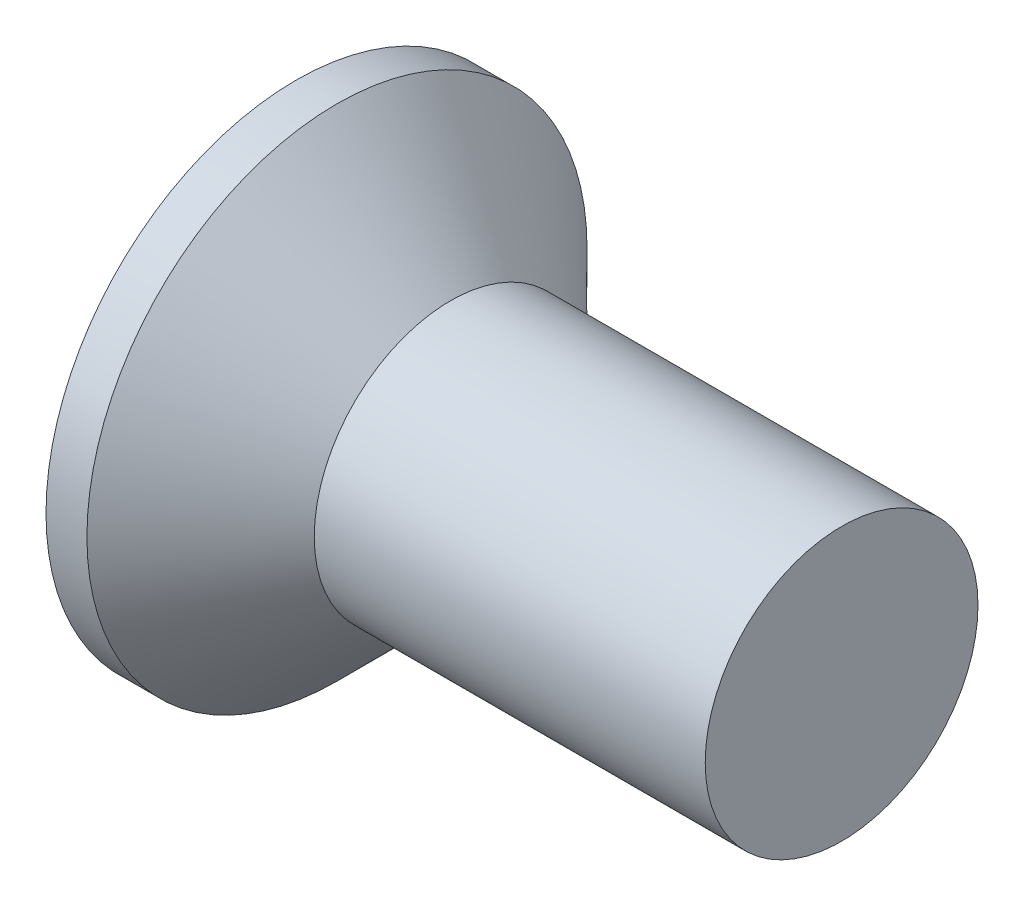
ISO-10303-21;
HEADER;
FILE_DESCRIPTION(('STEP AP214'),'2;1');
FILE_NAME('part.step','',(''),(''),'','','');
FILE_SCHEMA(('AUTOMOTIVE_DESIGN { 1 0 10303 214 1 1 1 1 }'));
ENDSEC;
DATA;
#1=APPLICATION_CONTEXT('core data for automotive mechanical design processes');
#2=APPLICATION_PROTOCOL_DEFINITION('international standard','automotive_design',2000,#1);
#3=PRODUCT_CONTEXT('',#1,'mechanical');
#4=PRODUCT('Part','Part','',(#3));
#5=PRODUCT_RELATED_PRODUCT_CATEGORY('part','',(#4));
#6=PRODUCT_DEFINITION_FORMATION('','',#4);
#7=PRODUCT_DEFINITION_CONTEXT('part definition',#1,'design');
#8=PRODUCT_DEFINITION('design','',#6,#7);
#9=PRODUCT_DEFINITION_SHAPE('','',#8);
#10=(LENGTH_UNIT() NAMED_UNIT(*) SI_UNIT(.MILLI.,.METRE.));
#11=(NAMED_UNIT(*) PLANE_ANGLE_UNIT() SI_UNIT($,.RADIAN.));
#12=(NAMED_UNIT(*) SI_UNIT($,.STERADIAN.) SOLID_ANGLE_UNIT());
#13=UNCERTAINTY_MEASURE_WITH_UNIT(LENGTH_MEASURE(1.E-05),#10,'distance_accuracy_value','');
#14=(GEOMETRIC_REPRESENTATION_CONTEXT(3) GLOBAL_UNCERTAINTY_ASSIGNED_CONTEXT((#13)) GLOBAL_UNIT_ASSIGNED_CONTEXT((#10,
#11,#12)) REPRESENTATION_CONTEXT('',''));
#15=CARTESIAN_POINT('',(0.,0.,0.));
#16=DIRECTION('',(0.,0.,1.));
#17=DIRECTION('',(1.,0.,0.));
#18=AXIS2_PLACEMENT_3D('',#15,#16,#17);
#19=CARTESIAN_POINT('',(0.,0.,0.));
#20=DIRECTION('',(-1.,0.,0.));
#21=DIRECTION('',(0.,0.,1.));
#22=AXIS2_PLACEMENT_3D('',#19,#20,#21);
#23=PLANE('',#22);
#24=CARTESIAN_POINT('',(0.,0.,0.));
#25=DIRECTION('',(-1.,0.,0.));
#26=DIRECTION('',(0.,0.,1.));
#27=AXIS2_PLACEMENT_3D('',#24,#25,#26);
#28=CIRCLE('',#27,2.75);
#29=CARTESIAN_POINT('',(0.,0.,2.75));
#30=VERTEX_POINT('',#29);
#31=EDGE_CURVE('E41',#30,#30,#28,.T.);
#32=ORIENTED_EDGE('',*,*,#31,.T.);
#33=EDGE_LOOP('',(#32));
#34=FACE_BOUND('',#33,.T.);
#35=DIRECTION('',(0.,1.,0.));
#36=VECTOR('',#35,1.);
#37=CARTESIAN_POINT('',(0.,-1.55,-0.395));
#38=LINE('',#37,#36);
#39=CARTESIAN_POINT('',(0.,-1.55,-0.395));
#40=VERTEX_POINT('',#39);
#41=CARTESIAN_POINT('',(0.,-0.394999999999999,-0.395));
#42=VERTEX_POINT('',#41);
#43=EDGE_CURVE('E102',#40,#42,#38,.T.);
#44=ORIENTED_EDGE('',*,*,#43,.T.);
#45=DIRECTION('',(0.,0.,-1.));
#46=VECTOR('',#45,1.);
#47=CARTESIAN_POINT('',(0.,-0.395000000000005,1.55));
#48=LINE('',#47,#46);
#49=CARTESIAN_POINT('',(0.,-0.394999999999995,-1.55));
#50=VERTEX_POINT('',#49);
#51=EDGE_CURVE('E82',#42,#50,#48,.T.);
#52=ORIENTED_EDGE('',*,*,#51,.T.);
#53=DIRECTION('',(0.,1.,0.));
#54=VECTOR('',#53,1.);
#55=CARTESIAN_POINT('',(0.,-0.394999999999995,-1.55));
#56=LINE('',#55,#54);
#57=CARTESIAN_POINT('',(0.,0.395000000000005,-1.55));
#58=VERTEX_POINT('',#57);
#59=EDGE_CURVE('E339',#50,#58,#56,.T.);
#60=ORIENTED_EDGE('',*,*,#59,.T.);
#61=DIRECTION('',(0.,0.,1.));
#62=VECTOR('',#61,1.);
#63=CARTESIAN_POINT('',(0.,0.395000000000005,-1.55));
#64=LINE('',#63,#62);
#65=CARTESIAN_POINT('',(0.,0.395000000000001,-0.395));
#66=VERTEX_POINT('',#65);
#67=EDGE_CURVE('E98',#58,#66,#64,.T.);
#68=ORIENTED_EDGE('',*,*,#67,.T.);
#69=CARTESIAN_POINT('',(0.,1.55,-0.395));
#70=VERTEX_POINT('',#69);
#71=EDGE_CURVE('E92',#66,#70,#38,.T.);
#72=ORIENTED_EDGE('',*,*,#71,.T.);
#73=DIRECTION('',(0.,0.,1.));
#74=VECTOR('',#73,1.);
#75=CARTESIAN_POINT('',(0.,1.55,-0.395));
#76=LINE('',#75,#74);
#77=CARTESIAN_POINT('',(0.,1.55,0.395));
#78=VERTEX_POINT('',#77);
#79=EDGE_CURVE('E95',#70,#78,#76,.T.);
#80=ORIENTED_EDGE('',*,*,#79,.T.);
#81=DIRECTION('',(0.,-1.,0.));
#82=VECTOR('',#81,1.);
#83=CARTESIAN_POINT('',(0.,1.55,0.395));
#84=LINE('',#83,#82);
#85=CARTESIAN_POINT('',(0.,0.394999999999998,0.395));
#86=VERTEX_POINT('',#85);
#87=EDGE_CURVE('E351',#78,#86,#84,.T.);
#88=ORIENTED_EDGE('',*,*,#87,.T.);
#89=CARTESIAN_POINT('',(0.,0.394999999999994,1.55));
#90=VERTEX_POINT('',#89);
#91=EDGE_CURVE('E334',#86,#90,#64,.T.);
#92=ORIENTED_EDGE('',*,*,#91,.T.);
#93=DIRECTION('',(0.,-1.,0.));
#94=VECTOR('',#93,1.);
#95=CARTESIAN_POINT('',(0.,0.394999999999994,1.55));
#96=LINE('',#95,#94);
#97=CARTESIAN_POINT('',(0.,-0.395000000000005,1.55));
#98=VERTEX_POINT('',#97);
#99=EDGE_CURVE('E320',#90,#98,#96,.T.);
#100=ORIENTED_EDGE('',*,*,#99,.T.);
#101=CARTESIAN_POINT('',(0.,-0.395000000000001,0.395));
#102=VERTEX_POINT('',#101);
#103=EDGE_CURVE('E332',#98,#102,#48,.T.);
#104=ORIENTED_EDGE('',*,*,#103,.T.);
#105=CARTESIAN_POINT('',(0.,-1.55,0.395));
#106=VERTEX_POINT('',#105);
#107=EDGE_CURVE('E108',#102,#106,#84,.T.);
#108=ORIENTED_EDGE('',*,*,#107,.T.);
#109=DIRECTION('',(0.,0.,-1.));
#110=VECTOR('',#109,1.);
#111=CARTESIAN_POINT('',(0.,-1.55,0.395));
#112=LINE('',#111,#110);
#113=EDGE_CURVE('E131',#106,#40,#112,.T.);
#114=ORIENTED_EDGE('',*,*,#113,.T.);
#115=EDGE_LOOP('',(#44,#52,#60,#68,#72,#80,#88,#92,#100,#104,#108,#114));
#116=FACE_BOUND('',#115,.T.);
#117=ADVANCED_FACE('F34',(#34,#116),#23,.T.);
#118=CARTESIAN_POINT('',(2.38373382624769,0.,0.16865988909427));
#119=DIRECTION('',(-0.0945267588569115,0.,-0.995522321125954));
#120=DIRECTION('',(-0.995522321125954,0.,0.0945267588569115));
#121=AXIS2_PLACEMENT_3D('',#118,#119,#120);
#122=PLANE('',#121);
#123=ORIENTED_EDGE('',*,*,#107,.F.);
#124=DIRECTION('',(0.991104257398676,0.0941072552097304,-0.0941072552097301));
#125=VECTOR('',#124,1.);
#126=CARTESIAN_POINT('',(2.39946475118715,-0.16716620751949,0.167166207519489));
#127=LINE('',#126,#125);
#128=CARTESIAN_POINT('',(2.08,-0.197500000000001,0.197499999999999));
#129=VERTEX_POINT('',#128);
#130=EDGE_CURVE('E126',#102,#129,#127,.T.);
#131=ORIENTED_EDGE('',*,*,#130,.T.);
#132=DIRECTION('',(0.835707904588477,0.543411029305728,-0.0793520726712617));
#133=VECTOR('',#132,1.);
#134=CARTESIAN_POINT('',(0.,-1.55,0.395));
#135=LINE('',#134,#133);
#136=EDGE_CURVE('E103',#106,#129,#135,.T.);
#137=ORIENTED_EDGE('',*,*,#136,.F.);
#138=EDGE_LOOP('',(#123,#131,#137));
#139=FACE_BOUND('',#138,.T.);
#140=ADVANCED_FACE('F154',(#139),#122,.T.);
#141=DIRECTION('',(0.835707904588477,-0.543411029305729,-0.0793520726712616));
#142=VECTOR('',#141,1.);
#143=CARTESIAN_POINT('',(0.,1.55,0.395));
#144=LINE('',#143,#142);
#145=CARTESIAN_POINT('',(2.08,0.1975,0.1975));
#146=VERTEX_POINT('',#145);
#147=EDGE_CURVE('E48',#78,#146,#144,.T.);
#148=ORIENTED_EDGE('',*,*,#147,.T.);
#149=DIRECTION('',(-0.991104257398676,0.0941072552097296,0.09410725520973));
#150=VECTOR('',#149,1.);
#151=CARTESIAN_POINT('',(2.39946475118715,0.167166207519489,0.167166207519489));
#152=LINE('',#151,#150);
#153=EDGE_CURVE('E347',#146,#86,#152,.T.);
#154=ORIENTED_EDGE('',*,*,#153,.T.);
#155=ORIENTED_EDGE('',*,*,#87,.F.);
#156=EDGE_LOOP('',(#148,#154,#155));
#157=FACE_BOUND('',#156,.T.);
#158=ADVANCED_FACE('F158',(#157),#122,.T.);
#159=CARTESIAN_POINT('',(2.38373382624769,0.,-0.16865988909427));
#160=DIRECTION('',(-0.0945267588569114,0.,0.995522321125954));
#161=DIRECTION('',(0.995522321125954,0.,0.0945267588569114));
#162=AXIS2_PLACEMENT_3D('',#159,#160,#161);
#163=PLANE('',#162);
#164=DIRECTION('',(0.835707904588477,0.543411029305729,0.0793520726712616));
#165=VECTOR('',#164,1.);
#166=CARTESIAN_POINT('',(0.,-1.55,-0.395));
#167=LINE('',#166,#165);
#168=CARTESIAN_POINT('',(2.08,-0.197499999999999,-0.197500000000001));
#169=VERTEX_POINT('',#168);
#170=EDGE_CURVE('E57',#40,#169,#167,.T.);
#171=ORIENTED_EDGE('',*,*,#170,.T.);
#172=DIRECTION('',(-0.991104257398676,-0.0941072552097297,-0.09410725520973));
#173=VECTOR('',#172,1.);
#174=CARTESIAN_POINT('',(2.39946475118715,-0.167166207519489,-0.167166207519489));
#175=LINE('',#174,#173);
#176=EDGE_CURVE('E11',#169,#42,#175,.T.);
#177=ORIENTED_EDGE('',*,*,#176,.T.);
#178=ORIENTED_EDGE('',*,*,#43,.F.);
#179=EDGE_LOOP('',(#171,#177,#178));
#180=FACE_BOUND('',#179,.T.);
#181=ADVANCED_FACE('F151',(#180),#163,.T.);
#182=ORIENTED_EDGE('',*,*,#71,.F.);
#183=DIRECTION('',(0.991104257398676,-0.0941072552097303,0.09410725520973));
#184=VECTOR('',#183,1.);
#185=CARTESIAN_POINT('',(2.39946475118715,0.16716620751949,-0.167166207519489));
#186=LINE('',#185,#184);
#187=CARTESIAN_POINT('',(2.08,0.1975,-0.1975));
#188=VERTEX_POINT('',#187);
#189=EDGE_CURVE('E111',#66,#188,#186,.T.);
#190=ORIENTED_EDGE('',*,*,#189,.T.);
#191=DIRECTION('',(0.835707904588477,-0.543411029305729,0.0793520726712616));
#192=VECTOR('',#191,1.);
#193=CARTESIAN_POINT('',(0.,1.55,-0.395));
#194=LINE('',#193,#192);
#195=EDGE_CURVE('E107',#70,#188,#194,.T.);
#196=ORIENTED_EDGE('',*,*,#195,.F.);
#197=EDGE_LOOP('',(#182,#190,#196));
#198=FACE_BOUND('',#197,.T.);
#199=ADVANCED_FACE('F110',(#198),#163,.T.);
#200=CARTESIAN_POINT('',(-6.34999999999999,0.,0.));
#201=DIRECTION('',(-1.,0.,0.));
#202=DIRECTION('',(0.,0.,1.));
#203=AXIS2_PLACEMENT_3D('',#200,#201,#202);
#204=CYLINDRICAL_SURFACE('',#203,2.75);
#205=CARTESIAN_POINT('',(0.450000000000005,0.,0.));
#206=DIRECTION('',(-1.,0.,0.));
#207=DIRECTION('',(0.,0.,1.));
#208=AXIS2_PLACEMENT_3D('',#205,#206,#207);
#209=CIRCLE('',#208,2.75);
#210=CARTESIAN_POINT('',(0.450000000000005,0.,2.75));
#211=VERTEX_POINT('',#210);
#212=EDGE_CURVE('E134',#211,#211,#209,.T.);
#213=ORIENTED_EDGE('',*,*,#212,.T.);
#214=EDGE_LOOP('',(#213));
#215=FACE_BOUND('',#214,.T.);
#216=ORIENTED_EDGE('',*,*,#31,.F.);
#217=EDGE_LOOP('',(#216));
#218=FACE_BOUND('',#217,.T.);
#219=ADVANCED_FACE('F140',(#215,#218),#204,.T.);
#220=CARTESIAN_POINT('',(0.450000000000005,0.,0.));
#221=DIRECTION('',(-1.,0.,0.));
#222=DIRECTION('',(0.,0.,1.));
#223=AXIS2_PLACEMENT_3D('',#220,#221,#222);
#224=CONICAL_SURFACE('',#223,2.75,0.78539816339745);
#225=CARTESIAN_POINT('',(1.7,0.,0.));
#226=DIRECTION('',(-1.,0.,0.));
#227=DIRECTION('',(0.,0.,1.));
#228=AXIS2_PLACEMENT_3D('',#225,#226,#227);
#229=CIRCLE('',#228,1.5);
#230=CARTESIAN_POINT('',(1.7,0.,1.5));
#231=VERTEX_POINT('',#230);
#232=EDGE_CURVE('E130',#231,#231,#229,.T.);
#233=ORIENTED_EDGE('',*,*,#232,.T.);
#234=EDGE_LOOP('',(#233));
#235=FACE_BOUND('',#234,.T.);
#236=ORIENTED_EDGE('',*,*,#212,.F.);
#237=EDGE_LOOP('',(#236));
#238=FACE_BOUND('',#237,.T.);
#239=ADVANCED_FACE('F142',(#235,#238),#224,.T.);
#240=CARTESIAN_POINT('',(-6.34999999999999,0.,0.));
#241=DIRECTION('',(-1.,0.,0.));
#242=DIRECTION('',(0.,0.,1.));
#243=AXIS2_PLACEMENT_3D('',#240,#241,#242);
#244=CYLINDRICAL_SURFACE('',#243,1.5);
#245=CARTESIAN_POINT('',(6.,0.,0.));
#246=DIRECTION('',(-1.,0.,0.));
#247=DIRECTION('',(0.,0.,1.));
#248=AXIS2_PLACEMENT_3D('',#245,#246,#247);
#249=CIRCLE('',#248,1.5);
#250=CARTESIAN_POINT('',(6.,0.,1.5));
#251=VERTEX_POINT('',#250);
#252=EDGE_CURVE('E127',#251,#251,#249,.T.);
#253=ORIENTED_EDGE('',*,*,#252,.T.);
#254=EDGE_LOOP('',(#253));
#255=FACE_BOUND('',#254,.T.);
#256=ORIENTED_EDGE('',*,*,#232,.F.);
#257=EDGE_LOOP('',(#256));
#258=FACE_BOUND('',#257,.T.);
#259=ADVANCED_FACE('F148',(#255,#258),#244,.T.);
#260=CARTESIAN_POINT('',(6.,1.5,0.));
#261=DIRECTION('',(1.,0.,0.));
#262=DIRECTION('',(0.,0.,-1.));
#263=AXIS2_PLACEMENT_3D('',#260,#261,#262);
#264=PLANE('',#263);
#265=ORIENTED_EDGE('',*,*,#252,.F.);
#266=EDGE_LOOP('',(#265));
#267=FACE_BOUND('',#266,.T.);
#268=ADVANCED_FACE('F178',(#267),#264,.T.);
#269=CARTESIAN_POINT('',(2.08,0.1975,-0.1975));
#270=DIRECTION('',(1.,0.,0.));
#271=DIRECTION('',(0.,0.,-1.));
#272=AXIS2_PLACEMENT_3D('',#269,#270,#271);
#273=PLANE('',#272);
#274=DIRECTION('',(0.,1.,0.));
#275=VECTOR('',#274,1.);
#276=CARTESIAN_POINT('',(2.08,-0.1975,-0.1975));
#277=LINE('',#276,#275);
#278=EDGE_CURVE('E122',#169,#188,#277,.T.);
#279=ORIENTED_EDGE('',*,*,#278,.F.);
#280=DIRECTION('',(0.,0.,-1.));
#281=VECTOR('',#280,1.);
#282=CARTESIAN_POINT('',(2.08,-0.1975,0.1975));
#283=LINE('',#282,#281);
#284=EDGE_CURVE('E113',#129,#169,#283,.T.);
#285=ORIENTED_EDGE('',*,*,#284,.F.);
#286=DIRECTION('',(0.,-1.,0.));
#287=VECTOR('',#286,1.);
#288=CARTESIAN_POINT('',(2.08,0.1975,0.1975));
#289=LINE('',#288,#287);
#290=EDGE_CURVE('E116',#146,#129,#289,.T.);
#291=ORIENTED_EDGE('',*,*,#290,.F.);
#292=DIRECTION('',(0.,0.,1.));
#293=VECTOR('',#292,1.);
#294=CARTESIAN_POINT('',(2.08,0.1975,-0.1975));
#295=LINE('',#294,#293);
#296=EDGE_CURVE('E120',#188,#146,#295,.T.);
#297=ORIENTED_EDGE('',*,*,#296,.F.);
#298=EDGE_LOOP('',(#279,#285,#291,#297));
#299=FACE_BOUND('',#298,.T.);
#300=ADVANCED_FACE('F175',(#299),#273,.F.);
#301=CARTESIAN_POINT('',(0.,-1.55,-0.395));
#302=DIRECTION('',(-0.54513001368185,0.838351518268576,0.));
#303=DIRECTION('',(-0.838351518268576,-0.54513001368185,0.));
#304=AXIS2_PLACEMENT_3D('',#301,#302,#303);
#305=PLANE('',#304);
#306=ORIENTED_EDGE('',*,*,#170,.F.);
#307=ORIENTED_EDGE('',*,*,#113,.F.);
#308=ORIENTED_EDGE('',*,*,#136,.T.);
#309=ORIENTED_EDGE('',*,*,#284,.T.);
#310=EDGE_LOOP('',(#306,#307,#308,#309));
#311=FACE_BOUND('',#310,.T.);
#312=ADVANCED_FACE('F167',(#311),#305,.T.);
#313=CARTESIAN_POINT('',(0.,1.55,0.395));
#314=DIRECTION('',(-0.54513001368185,-0.838351518268576,0.));
#315=DIRECTION('',(0.838351518268576,-0.54513001368185,0.));
#316=AXIS2_PLACEMENT_3D('',#313,#314,#315);
#317=PLANE('',#316);
#318=ORIENTED_EDGE('',*,*,#147,.F.);
#319=ORIENTED_EDGE('',*,*,#79,.F.);
#320=ORIENTED_EDGE('',*,*,#195,.T.);
#321=ORIENTED_EDGE('',*,*,#296,.T.);
#322=EDGE_LOOP('',(#318,#319,#320,#321));
#323=FACE_BOUND('',#322,.T.);
#324=ADVANCED_FACE('F106',(#323),#317,.T.);
#325=CARTESIAN_POINT('',(2.38373382624769,-0.16865988909427,0.));
#326=DIRECTION('',(-0.0945267588569115,0.995522321125954,0.));
#327=DIRECTION('',(-0.995522321125954,-0.0945267588569115,0.));
#328=AXIS2_PLACEMENT_3D('',#325,#326,#327);
#329=PLANE('',#328);
#330=DIRECTION('',(0.835707904588477,0.0793520726712598,0.543411029305729));
#331=VECTOR('',#330,1.);
#332=CARTESIAN_POINT('',(0.,-0.394999999999995,-1.55));
#333=LINE('',#332,#331);
#334=EDGE_CURVE('E341',#50,#169,#333,.T.);
#335=ORIENTED_EDGE('',*,*,#334,.F.);
#336=ORIENTED_EDGE('',*,*,#51,.F.);
#337=ORIENTED_EDGE('',*,*,#176,.F.);
#338=EDGE_LOOP('',(#335,#336,#337));
#339=FACE_BOUND('',#338,.T.);
#340=ADVANCED_FACE('F174',(#339),#329,.T.);
#341=CARTESIAN_POINT('',(2.38373382624769,0.16865988909427,0.));
#342=DIRECTION('',(-0.0945267588569114,-0.995522321125954,0.));
#343=DIRECTION('',(0.995522321125954,-0.0945267588569114,0.));
#344=AXIS2_PLACEMENT_3D('',#341,#342,#343);
#345=PLANE('',#344);
#346=ORIENTED_EDGE('',*,*,#67,.F.);
#347=DIRECTION('',(0.835707904588477,-0.0793520726712635,0.543411029305728));
#348=VECTOR('',#347,1.);
#349=CARTESIAN_POINT('',(0.,0.395000000000005,-1.55));
#350=LINE('',#349,#348);
#351=EDGE_CURVE('E73',#58,#188,#350,.T.);
#352=ORIENTED_EDGE('',*,*,#351,.T.);
#353=ORIENTED_EDGE('',*,*,#189,.F.);
#354=EDGE_LOOP('',(#346,#352,#353));
#355=FACE_BOUND('',#354,.T.);
#356=ADVANCED_FACE('F218',(#355),#345,.T.);
#357=CARTESIAN_POINT('',(0.,0.395000000000005,-1.55));
#358=DIRECTION('',(-0.54513001368185,0.,0.838351518268576));
#359=DIRECTION('',(-0.838351518268576,0.,-0.54513001368185));
#360=AXIS2_PLACEMENT_3D('',#357,#358,#359);
#361=PLANE('',#360);
#362=ORIENTED_EDGE('',*,*,#351,.F.);
#363=ORIENTED_EDGE('',*,*,#59,.F.);
#364=ORIENTED_EDGE('',*,*,#334,.T.);
#365=ORIENTED_EDGE('',*,*,#278,.T.);
#366=EDGE_LOOP('',(#362,#363,#364,#365));
#367=FACE_BOUND('',#366,.T.);
#368=ADVANCED_FACE('F226',(#367),#361,.T.);
#369=ORIENTED_EDGE('',*,*,#103,.F.);
#370=DIRECTION('',(0.835707904588477,0.0793520726712635,-0.543411029305728));
#371=VECTOR('',#370,1.);
#372=CARTESIAN_POINT('',(0.,-0.395000000000005,1.55));
#373=LINE('',#372,#371);
#374=EDGE_CURVE('E317',#98,#129,#373,.T.);
#375=ORIENTED_EDGE('',*,*,#374,.T.);
#376=ORIENTED_EDGE('',*,*,#130,.F.);
#377=EDGE_LOOP('',(#369,#375,#376));
#378=FACE_BOUND('',#377,.T.);
#379=ADVANCED_FACE('F220',(#378),#329,.T.);
#380=DIRECTION('',(0.835707904588477,-0.0793520726712597,-0.543411029305729));
#381=VECTOR('',#380,1.);
#382=CARTESIAN_POINT('',(0.,0.394999999999994,1.55));
#383=LINE('',#382,#381);
#384=EDGE_CURVE('E328',#90,#146,#383,.T.);
#385=ORIENTED_EDGE('',*,*,#384,.F.);
#386=ORIENTED_EDGE('',*,*,#91,.F.);
#387=ORIENTED_EDGE('',*,*,#153,.F.);
#388=EDGE_LOOP('',(#385,#386,#387));
#389=FACE_BOUND('',#388,.T.);
#390=ADVANCED_FACE('F228',(#389),#345,.T.);
#391=CARTESIAN_POINT('',(0.,-0.395000000000005,1.55));
#392=DIRECTION('',(-0.54513001368185,0.,-0.838351518268576));
#393=DIRECTION('',(0.838351518268576,0.,-0.54513001368185));
#394=AXIS2_PLACEMENT_3D('',#391,#392,#393);
#395=PLANE('',#394);
#396=ORIENTED_EDGE('',*,*,#374,.F.);
#397=ORIENTED_EDGE('',*,*,#99,.F.);
#398=ORIENTED_EDGE('',*,*,#384,.T.);
#399=ORIENTED_EDGE('',*,*,#290,.T.);
#400=EDGE_LOOP('',(#396,#397,#398,#399));
#401=FACE_BOUND('',#400,.T.);
#402=ADVANCED_FACE('F247',(#401),#395,.T.);
#403=CLOSED_SHELL('',(#117,#140,#158,#181,#199,#219,#239,#259,#268,#300,#312,#324,#340,#356,
#368,#379,#390,#402));
#404=MANIFOLD_SOLID_BREP('B2',#403);
#405=ADVANCED_BREP_SHAPE_REPRESENTATION('',(#18,#404),#14);
#406=SHAPE_DEFINITION_REPRESENTATION(#9,#405);
ENDSEC;
END-ISO-10303-21;
